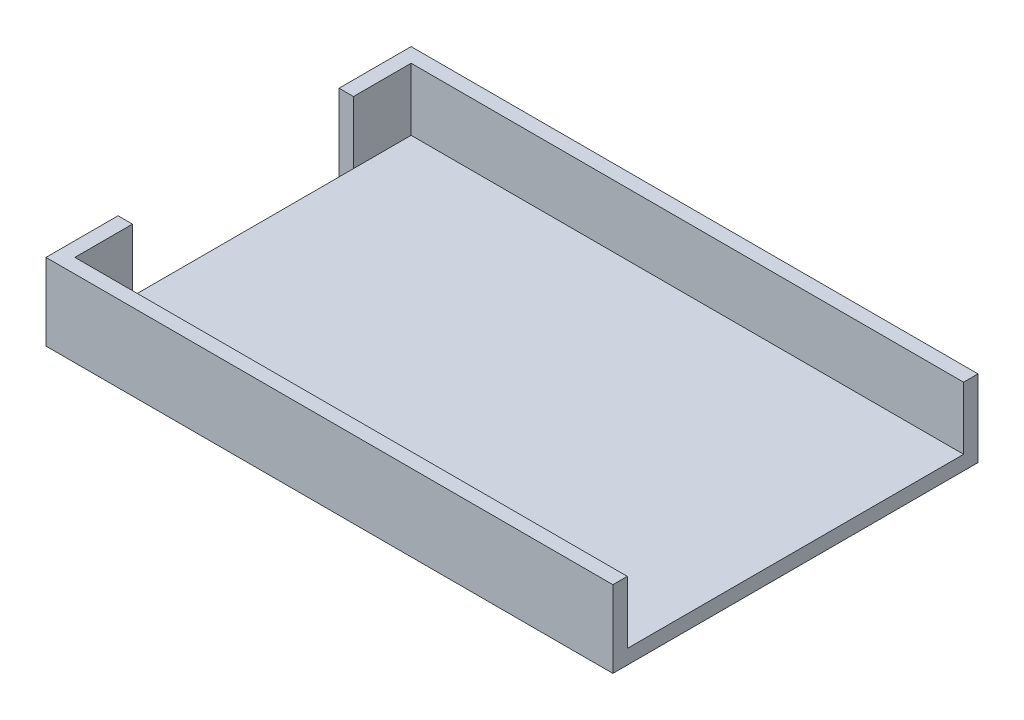
ISO-10303-21;
HEADER;
FILE_DESCRIPTION(('STEP AP214'),'2;1');
FILE_NAME('part.step','',(''),(''),'','','');
FILE_SCHEMA(('AUTOMOTIVE_DESIGN { 1 0 10303 214 1 1 1 1 }'));
ENDSEC;
DATA;
#1=APPLICATION_CONTEXT('core data for automotive mechanical design processes');
#2=APPLICATION_PROTOCOL_DEFINITION('international standard','automotive_design',2000,#1);
#3=PRODUCT_CONTEXT('',#1,'mechanical');
#4=PRODUCT('Part','Part','',(#3));
#5=PRODUCT_RELATED_PRODUCT_CATEGORY('part','',(#4));
#6=PRODUCT_DEFINITION_FORMATION('','',#4);
#7=PRODUCT_DEFINITION_CONTEXT('part definition',#1,'design');
#8=PRODUCT_DEFINITION('design','',#6,#7);
#9=PRODUCT_DEFINITION_SHAPE('','',#8);
#10=(LENGTH_UNIT() NAMED_UNIT(*) SI_UNIT(.MILLI.,.METRE.));
#11=(NAMED_UNIT(*) PLANE_ANGLE_UNIT() SI_UNIT($,.RADIAN.));
#12=(NAMED_UNIT(*) SI_UNIT($,.STERADIAN.) SOLID_ANGLE_UNIT());
#13=UNCERTAINTY_MEASURE_WITH_UNIT(LENGTH_MEASURE(1.E-05),#10,'distance_accuracy_value','');
#14=(GEOMETRIC_REPRESENTATION_CONTEXT(3) GLOBAL_UNCERTAINTY_ASSIGNED_CONTEXT((#13)) GLOBAL_UNIT_ASSIGNED_CONTEXT((#10,
#11,#12)) REPRESENTATION_CONTEXT('',''));
#15=CARTESIAN_POINT('',(0.,0.,0.));
#16=DIRECTION('',(0.,0.,1.));
#17=DIRECTION('',(1.,0.,0.));
#18=AXIS2_PLACEMENT_3D('',#15,#16,#17);
#19=CARTESIAN_POINT('',(-81.5855731865285,4.7625,-39.8468669041451));
#20=DIRECTION('',(1.,0.,0.));
#21=DIRECTION('',(0.,0.,-1.));
#22=AXIS2_PLACEMENT_3D('',#19,#20,#21);
#23=PLANE('',#22);
#24=DIRECTION('',(0.,0.,1.));
#25=VECTOR('',#24,1.);
#26=CARTESIAN_POINT('',(-81.5855731865285,4.7625,-39.8468669041451));
#27=LINE('',#26,#25);
#28=CARTESIAN_POINT('',(-81.5855731865285,4.7625,-20.7968669041451));
#29=VERTEX_POINT('',#28);
#30=CARTESIAN_POINT('',(-81.5855731865285,4.7625,52.2281330958549));
#31=VERTEX_POINT('',#30);
#32=EDGE_CURVE('E49',#29,#31,#27,.T.);
#33=ORIENTED_EDGE('',*,*,#32,.F.);
#34=DIRECTION('',(0.,-1.,0.));
#35=VECTOR('',#34,1.);
#36=CARTESIAN_POINT('',(-81.5855731865285,25.4,-20.7968669041451));
#37=LINE('',#36,#35);
#38=CARTESIAN_POINT('',(-81.5855731865285,0.,-20.7968669041451));
#39=VERTEX_POINT('',#38);
#40=EDGE_CURVE('E136',#29,#39,#37,.T.);
#41=ORIENTED_EDGE('',*,*,#40,.T.);
#42=DIRECTION('',(0.,0.,1.));
#43=VECTOR('',#42,1.);
#44=CARTESIAN_POINT('',(-81.5855731865285,0.,-39.8468669041451));
#45=LINE('',#44,#43);
#46=CARTESIAN_POINT('',(-81.5855731865285,0.,52.2281330958549));
#47=VERTEX_POINT('',#46);
#48=EDGE_CURVE('E228',#39,#47,#45,.T.);
#49=ORIENTED_EDGE('',*,*,#48,.T.);
#50=DIRECTION('',(0.,-1.,0.));
#51=VECTOR('',#50,1.);
#52=CARTESIAN_POINT('',(-81.5855731865285,25.4,52.2281330958549));
#53=LINE('',#52,#51);
#54=EDGE_CURVE('E215',#31,#47,#53,.T.);
#55=ORIENTED_EDGE('',*,*,#54,.F.);
#56=EDGE_LOOP('',(#33,#41,#49,#55));
#57=FACE_BOUND('',#56,.T.);
#58=ADVANCED_FACE('F33',(#57),#23,.F.);
#59=CARTESIAN_POINT('',(100.976926813471,4.7625,-39.8468669041451));
#60=DIRECTION('',(-1.,0.,0.));
#61=DIRECTION('',(0.,0.,1.));
#62=AXIS2_PLACEMENT_3D('',#59,#60,#61);
#63=PLANE('',#62);
#64=DIRECTION('',(0.,0.,-1.));
#65=VECTOR('',#64,1.);
#66=CARTESIAN_POINT('',(100.976926813471,0.,-39.8468669041451));
#67=LINE('',#66,#65);
#68=CARTESIAN_POINT('',(100.976926813471,0.,76.0406330958549));
#69=VERTEX_POINT('',#68);
#70=CARTESIAN_POINT('',(100.976926813471,0.,-44.6093669041451));
#71=VERTEX_POINT('',#70);
#72=EDGE_CURVE('E36',#69,#71,#67,.T.);
#73=ORIENTED_EDGE('',*,*,#72,.T.);
#74=DIRECTION('',(0.,-1.,0.));
#75=VECTOR('',#74,1.);
#76=CARTESIAN_POINT('',(100.976926813471,25.4,-44.6093669041451));
#77=LINE('',#76,#75);
#78=CARTESIAN_POINT('',(100.976926813471,25.4,-44.6093669041451));
#79=VERTEX_POINT('',#78);
#80=EDGE_CURVE('E173',#79,#71,#77,.T.);
#81=ORIENTED_EDGE('',*,*,#80,.F.);
#82=DIRECTION('',(0.,0.,1.));
#83=VECTOR('',#82,1.);
#84=CARTESIAN_POINT('',(100.976926813471,25.4,-44.6093669041451));
#85=LINE('',#84,#83);
#86=CARTESIAN_POINT('',(100.976926813471,25.4,-39.8468669041451));
#87=VERTEX_POINT('',#86);
#88=EDGE_CURVE('E137',#79,#87,#85,.T.);
#89=ORIENTED_EDGE('',*,*,#88,.T.);
#90=DIRECTION('',(0.,-1.,0.));
#91=VECTOR('',#90,1.);
#92=CARTESIAN_POINT('',(100.976926813471,25.4,-39.8468669041451));
#93=LINE('',#92,#91);
#94=CARTESIAN_POINT('',(100.976926813471,4.7625,-39.8468669041451));
#95=VERTEX_POINT('',#94);
#96=EDGE_CURVE('E152',#87,#95,#93,.T.);
#97=ORIENTED_EDGE('',*,*,#96,.T.);
#98=DIRECTION('',(0.,0.,-1.));
#99=VECTOR('',#98,1.);
#100=CARTESIAN_POINT('',(100.976926813471,4.7625,-39.8468669041451));
#101=LINE('',#100,#99);
#102=CARTESIAN_POINT('',(100.976926813471,4.7625,71.2781330958549));
#103=VERTEX_POINT('',#102);
#104=EDGE_CURVE('E41',#103,#95,#101,.T.);
#105=ORIENTED_EDGE('',*,*,#104,.F.);
#106=DIRECTION('',(0.,-1.,0.));
#107=VECTOR('',#106,1.);
#108=CARTESIAN_POINT('',(100.976926813471,25.4,71.2781330958549));
#109=LINE('',#108,#107);
#110=CARTESIAN_POINT('',(100.976926813471,25.4,71.2781330958549));
#111=VERTEX_POINT('',#110);
#112=EDGE_CURVE('E200',#111,#103,#109,.T.);
#113=ORIENTED_EDGE('',*,*,#112,.F.);
#114=DIRECTION('',(0.,0.,1.));
#115=VECTOR('',#114,1.);
#116=CARTESIAN_POINT('',(100.976926813471,25.4,71.2781330958549));
#117=LINE('',#116,#115);
#118=CARTESIAN_POINT('',(100.976926813471,25.4,76.0406330958549));
#119=VERTEX_POINT('',#118);
#120=EDGE_CURVE('E186',#111,#119,#117,.T.);
#121=ORIENTED_EDGE('',*,*,#120,.T.);
#122=DIRECTION('',(0.,-1.,0.));
#123=VECTOR('',#122,1.);
#124=CARTESIAN_POINT('',(100.976926813471,25.4,76.0406330958549));
#125=LINE('',#124,#123);
#126=EDGE_CURVE('E221',#119,#69,#125,.T.);
#127=ORIENTED_EDGE('',*,*,#126,.T.);
#128=EDGE_LOOP('',(#73,#81,#89,#97,#105,#113,#121,#127));
#129=FACE_BOUND('',#128,.T.);
#130=ADVANCED_FACE('F234',(#129),#63,.F.);
#131=CARTESIAN_POINT('',(0.,4.7625,0.));
#132=DIRECTION('',(0.,1.,0.));
#133=DIRECTION('',(0.,0.,1.));
#134=AXIS2_PLACEMENT_3D('',#131,#132,#133);
#135=PLANE('',#134);
#136=CARTESIAN_POINT('',(-81.5855731865285,4.7625,-39.8468669041451));
#137=VERTEX_POINT('',#136);
#138=EDGE_CURVE('E132',#137,#29,#27,.T.);
#139=ORIENTED_EDGE('',*,*,#138,.T.);
#140=ORIENTED_EDGE('',*,*,#32,.T.);
#141=DIRECTION('',(0.,0.,-1.));
#142=VECTOR('',#141,1.);
#143=CARTESIAN_POINT('',(-81.5855731865285,4.7625,0.));
#144=LINE('',#143,#142);
#145=CARTESIAN_POINT('',(-81.5855731865285,4.7625,71.2781330958549));
#146=VERTEX_POINT('',#145);
#147=EDGE_CURVE('E211',#146,#31,#144,.T.);
#148=ORIENTED_EDGE('',*,*,#147,.F.);
#149=DIRECTION('',(1.,0.,0.));
#150=VECTOR('',#149,1.);
#151=CARTESIAN_POINT('',(-81.5855731865285,4.7625,71.2781330958549));
#152=LINE('',#151,#150);
#153=EDGE_CURVE('E230',#146,#103,#152,.T.);
#154=ORIENTED_EDGE('',*,*,#153,.T.);
#155=ORIENTED_EDGE('',*,*,#104,.T.);
#156=DIRECTION('',(-1.,0.,0.));
#157=VECTOR('',#156,1.);
#158=CARTESIAN_POINT('',(-81.5855731865285,4.7625,-39.8468669041451));
#159=LINE('',#158,#157);
#160=EDGE_CURVE('E11',#95,#137,#159,.T.);
#161=ORIENTED_EDGE('',*,*,#160,.T.);
#162=EDGE_LOOP('',(#139,#140,#148,#154,#155,#161));
#163=FACE_BOUND('',#162,.T.);
#164=ADVANCED_FACE('F253',(#163),#135,.T.);
#165=CARTESIAN_POINT('',(0.,0.,0.));
#166=DIRECTION('',(0.,1.,0.));
#167=DIRECTION('',(0.,0.,1.));
#168=AXIS2_PLACEMENT_3D('',#165,#166,#167);
#169=PLANE('',#168);
#170=ORIENTED_EDGE('',*,*,#72,.F.);
#171=DIRECTION('',(-1.,0.,0.));
#172=VECTOR('',#171,1.);
#173=CARTESIAN_POINT('',(-86.3480731865285,0.,76.0406330958549));
#174=LINE('',#173,#172);
#175=CARTESIAN_POINT('',(-86.3480731865285,0.,76.0406330958549));
#176=VERTEX_POINT('',#175);
#177=EDGE_CURVE('E172',#69,#176,#174,.T.);
#178=ORIENTED_EDGE('',*,*,#177,.T.);
#179=DIRECTION('',(0.,0.,-1.));
#180=VECTOR('',#179,1.);
#181=CARTESIAN_POINT('',(-86.3480731865285,0.,71.2781330958549));
#182=LINE('',#181,#180);
#183=CARTESIAN_POINT('',(-86.3480731865285,0.,52.2281330958549));
#184=VERTEX_POINT('',#183);
#185=EDGE_CURVE('E203',#176,#184,#182,.T.);
#186=ORIENTED_EDGE('',*,*,#185,.T.);
#187=DIRECTION('',(1.,0.,0.));
#188=VECTOR('',#187,1.);
#189=CARTESIAN_POINT('',(-86.3480731865285,0.,52.2281330958549));
#190=LINE('',#189,#188);
#191=EDGE_CURVE('E187',#184,#47,#190,.T.);
#192=ORIENTED_EDGE('',*,*,#191,.T.);
#193=ORIENTED_EDGE('',*,*,#48,.F.);
#194=DIRECTION('',(-1.,0.,0.));
#195=VECTOR('',#194,1.);
#196=CARTESIAN_POINT('',(-86.3480731865285,0.,-20.7968669041451));
#197=LINE('',#196,#195);
#198=CARTESIAN_POINT('',(-86.3480731865285,0.,-20.7968669041451));
#199=VERTEX_POINT('',#198);
#200=EDGE_CURVE('E166',#39,#199,#197,.T.);
#201=ORIENTED_EDGE('',*,*,#200,.T.);
#202=DIRECTION('',(0.,0.,-1.));
#203=VECTOR('',#202,1.);
#204=CARTESIAN_POINT('',(-86.3480731865285,0.,-39.8468669041451));
#205=LINE('',#204,#203);
#206=CARTESIAN_POINT('',(-86.3480731865285,0.,-44.6093669041451));
#207=VERTEX_POINT('',#206);
#208=EDGE_CURVE('E156',#199,#207,#205,.T.);
#209=ORIENTED_EDGE('',*,*,#208,.T.);
#210=DIRECTION('',(1.,0.,0.));
#211=VECTOR('',#210,1.);
#212=CARTESIAN_POINT('',(-86.3480731865285,0.,-44.6093669041451));
#213=LINE('',#212,#211);
#214=EDGE_CURVE('E153',#207,#71,#213,.T.);
#215=ORIENTED_EDGE('',*,*,#214,.T.);
#216=EDGE_LOOP('',(#170,#178,#186,#192,#193,#201,#209,#215));
#217=FACE_BOUND('',#216,.T.);
#218=ADVANCED_FACE('F242',(#217),#169,.F.);
#219=CARTESIAN_POINT('',(-81.5855731865285,25.4,71.2781330958549));
#220=DIRECTION('',(0.,0.,-1.));
#221=DIRECTION('',(-1.,0.,0.));
#222=AXIS2_PLACEMENT_3D('',#219,#220,#221);
#223=PLANE('',#222);
#224=ORIENTED_EDGE('',*,*,#112,.T.);
#225=ORIENTED_EDGE('',*,*,#153,.F.);
#226=DIRECTION('',(0.,-1.,0.));
#227=VECTOR('',#226,1.);
#228=CARTESIAN_POINT('',(-81.5855731865285,25.4,71.2781330958549));
#229=LINE('',#228,#227);
#230=CARTESIAN_POINT('',(-81.5855731865285,25.4,71.2781330958549));
#231=VERTEX_POINT('',#230);
#232=EDGE_CURVE('E208',#231,#146,#229,.T.);
#233=ORIENTED_EDGE('',*,*,#232,.F.);
#234=DIRECTION('',(1.,0.,0.));
#235=VECTOR('',#234,1.);
#236=CARTESIAN_POINT('',(-81.5855731865285,25.4,71.2781330958549));
#237=LINE('',#236,#235);
#238=EDGE_CURVE('E183',#231,#111,#237,.T.);
#239=ORIENTED_EDGE('',*,*,#238,.T.);
#240=EDGE_LOOP('',(#224,#225,#233,#239));
#241=FACE_BOUND('',#240,.T.);
#242=ADVANCED_FACE('F260',(#241),#223,.T.);
#243=CARTESIAN_POINT('',(-81.5855731865285,25.4,52.2281330958549));
#244=DIRECTION('',(1.,0.,0.));
#245=DIRECTION('',(0.,0.,-1.));
#246=AXIS2_PLACEMENT_3D('',#243,#244,#245);
#247=PLANE('',#246);
#248=ORIENTED_EDGE('',*,*,#232,.T.);
#249=ORIENTED_EDGE('',*,*,#147,.T.);
#250=CARTESIAN_POINT('',(-81.5855731865285,25.4,52.2281330958549));
#251=VERTEX_POINT('',#250);
#252=EDGE_CURVE('E212',#251,#31,#53,.T.);
#253=ORIENTED_EDGE('',*,*,#252,.F.);
#254=DIRECTION('',(0.,0.,1.));
#255=VECTOR('',#254,1.);
#256=CARTESIAN_POINT('',(-81.5855731865285,25.4,52.2281330958549));
#257=LINE('',#256,#255);
#258=EDGE_CURVE('E197',#251,#231,#257,.T.);
#259=ORIENTED_EDGE('',*,*,#258,.T.);
#260=EDGE_LOOP('',(#248,#249,#253,#259));
#261=FACE_BOUND('',#260,.T.);
#262=ADVANCED_FACE('F264',(#261),#247,.T.);
#263=CARTESIAN_POINT('',(-86.3480731865285,25.4,52.2281330958549));
#264=DIRECTION('',(0.,0.,-1.));
#265=DIRECTION('',(-1.,0.,0.));
#266=AXIS2_PLACEMENT_3D('',#263,#264,#265);
#267=PLANE('',#266);
#268=ORIENTED_EDGE('',*,*,#191,.F.);
#269=DIRECTION('',(0.,-1.,0.));
#270=VECTOR('',#269,1.);
#271=CARTESIAN_POINT('',(-86.3480731865285,25.4,52.2281330958549));
#272=LINE('',#271,#270);
#273=CARTESIAN_POINT('',(-86.3480731865285,25.4,52.2281330958549));
#274=VERTEX_POINT('',#273);
#275=EDGE_CURVE('E216',#274,#184,#272,.T.);
#276=ORIENTED_EDGE('',*,*,#275,.F.);
#277=DIRECTION('',(1.,0.,0.));
#278=VECTOR('',#277,1.);
#279=CARTESIAN_POINT('',(-86.3480731865285,25.4,52.2281330958549));
#280=LINE('',#279,#278);
#281=EDGE_CURVE('E194',#274,#251,#280,.T.);
#282=ORIENTED_EDGE('',*,*,#281,.T.);
#283=ORIENTED_EDGE('',*,*,#252,.T.);
#284=ORIENTED_EDGE('',*,*,#54,.T.);
#285=EDGE_LOOP('',(#268,#276,#282,#283,#284));
#286=FACE_BOUND('',#285,.T.);
#287=ADVANCED_FACE('F274',(#286),#267,.T.);
#288=CARTESIAN_POINT('',(-86.3480731865285,25.4,71.2781330958549));
#289=DIRECTION('',(-1.,0.,0.));
#290=DIRECTION('',(0.,0.,1.));
#291=AXIS2_PLACEMENT_3D('',#288,#289,#290);
#292=PLANE('',#291);
#293=ORIENTED_EDGE('',*,*,#185,.F.);
#294=DIRECTION('',(0.,-1.,0.));
#295=VECTOR('',#294,1.);
#296=CARTESIAN_POINT('',(-86.3480731865285,25.4,76.0406330958549));
#297=LINE('',#296,#295);
#298=CARTESIAN_POINT('',(-86.3480731865285,25.4,76.0406330958549));
#299=VERTEX_POINT('',#298);
#300=EDGE_CURVE('E218',#299,#176,#297,.T.);
#301=ORIENTED_EDGE('',*,*,#300,.F.);
#302=DIRECTION('',(0.,0.,-1.));
#303=VECTOR('',#302,1.);
#304=CARTESIAN_POINT('',(-86.3480731865285,25.4,71.2781330958549));
#305=LINE('',#304,#303);
#306=EDGE_CURVE('E192',#299,#274,#305,.T.);
#307=ORIENTED_EDGE('',*,*,#306,.T.);
#308=ORIENTED_EDGE('',*,*,#275,.T.);
#309=EDGE_LOOP('',(#293,#301,#307,#308));
#310=FACE_BOUND('',#309,.T.);
#311=ADVANCED_FACE('F270',(#310),#292,.T.);
#312=CARTESIAN_POINT('',(-86.3480731865285,25.4,76.0406330958549));
#313=DIRECTION('',(0.,0.,1.));
#314=DIRECTION('',(1.,0.,0.));
#315=AXIS2_PLACEMENT_3D('',#312,#313,#314);
#316=PLANE('',#315);
#317=ORIENTED_EDGE('',*,*,#177,.F.);
#318=ORIENTED_EDGE('',*,*,#126,.F.);
#319=DIRECTION('',(-1.,0.,0.));
#320=VECTOR('',#319,1.);
#321=CARTESIAN_POINT('',(-81.5855731865285,25.4,76.0406330958549));
#322=LINE('',#321,#320);
#323=EDGE_CURVE('E190',#119,#299,#322,.T.);
#324=ORIENTED_EDGE('',*,*,#323,.T.);
#325=ORIENTED_EDGE('',*,*,#300,.T.);
#326=EDGE_LOOP('',(#317,#318,#324,#325));
#327=FACE_BOUND('',#326,.T.);
#328=ADVANCED_FACE('F266',(#327),#316,.T.);
#329=CARTESIAN_POINT('',(0.,25.4,0.));
#330=DIRECTION('',(0.,-1.,0.));
#331=DIRECTION('',(0.,0.,-1.));
#332=AXIS2_PLACEMENT_3D('',#329,#330,#331);
#333=PLANE('',#332);
#334=ORIENTED_EDGE('',*,*,#238,.F.);
#335=ORIENTED_EDGE('',*,*,#258,.F.);
#336=ORIENTED_EDGE('',*,*,#281,.F.);
#337=ORIENTED_EDGE('',*,*,#306,.F.);
#338=ORIENTED_EDGE('',*,*,#323,.F.);
#339=ORIENTED_EDGE('',*,*,#120,.F.);
#340=EDGE_LOOP('',(#334,#335,#336,#337,#338,#339));
#341=FACE_BOUND('',#340,.T.);
#342=ADVANCED_FACE('F269',(#341),#333,.F.);
#343=CARTESIAN_POINT('',(100.976926813471,25.4,-39.8468669041451));
#344=DIRECTION('',(0.,0.,1.));
#345=DIRECTION('',(1.,0.,0.));
#346=AXIS2_PLACEMENT_3D('',#343,#344,#345);
#347=PLANE('',#346);
#348=DIRECTION('',(0.,-1.,0.));
#349=VECTOR('',#348,1.);
#350=CARTESIAN_POINT('',(-81.5855731865285,25.4,-39.8468669041451));
#351=LINE('',#350,#349);
#352=CARTESIAN_POINT('',(-81.5855731865285,25.4,-39.8468669041451));
#353=VERTEX_POINT('',#352);
#354=EDGE_CURVE('E127',#353,#137,#351,.T.);
#355=ORIENTED_EDGE('',*,*,#354,.T.);
#356=ORIENTED_EDGE('',*,*,#160,.F.);
#357=ORIENTED_EDGE('',*,*,#96,.F.);
#358=DIRECTION('',(-1.,0.,0.));
#359=VECTOR('',#358,1.);
#360=CARTESIAN_POINT('',(100.976926813471,25.4,-39.8468669041451));
#361=LINE('',#360,#359);
#362=EDGE_CURVE('E144',#87,#353,#361,.T.);
#363=ORIENTED_EDGE('',*,*,#362,.T.);
#364=EDGE_LOOP('',(#355,#356,#357,#363));
#365=FACE_BOUND('',#364,.T.);
#366=ADVANCED_FACE('F150',(#365),#347,.T.);
#367=CARTESIAN_POINT('',(-86.3480731865285,25.4,-44.6093669041451));
#368=DIRECTION('',(0.,0.,-1.));
#369=DIRECTION('',(-1.,0.,0.));
#370=AXIS2_PLACEMENT_3D('',#367,#368,#369);
#371=PLANE('',#370);
#372=ORIENTED_EDGE('',*,*,#214,.F.);
#373=DIRECTION('',(0.,-1.,0.));
#374=VECTOR('',#373,1.);
#375=CARTESIAN_POINT('',(-86.3480731865285,25.4,-44.6093669041451));
#376=LINE('',#375,#374);
#377=CARTESIAN_POINT('',(-86.3480731865285,25.4,-44.6093669041451));
#378=VERTEX_POINT('',#377);
#379=EDGE_CURVE('E176',#378,#207,#376,.T.);
#380=ORIENTED_EDGE('',*,*,#379,.F.);
#381=DIRECTION('',(1.,0.,0.));
#382=VECTOR('',#381,1.);
#383=CARTESIAN_POINT('',(-86.3480731865285,25.4,-44.6093669041451));
#384=LINE('',#383,#382);
#385=EDGE_CURVE('E162',#378,#79,#384,.T.);
#386=ORIENTED_EDGE('',*,*,#385,.T.);
#387=ORIENTED_EDGE('',*,*,#80,.T.);
#388=EDGE_LOOP('',(#372,#380,#386,#387));
#389=FACE_BOUND('',#388,.T.);
#390=ADVANCED_FACE('F239',(#389),#371,.T.);
#391=CARTESIAN_POINT('',(-86.3480731865285,25.4,-39.8468669041451));
#392=DIRECTION('',(-1.,0.,0.));
#393=DIRECTION('',(0.,0.,1.));
#394=AXIS2_PLACEMENT_3D('',#391,#392,#393);
#395=PLANE('',#394);
#396=ORIENTED_EDGE('',*,*,#208,.F.);
#397=DIRECTION('',(0.,-1.,0.));
#398=VECTOR('',#397,1.);
#399=CARTESIAN_POINT('',(-86.3480731865285,25.4,-20.7968669041451));
#400=LINE('',#399,#398);
#401=CARTESIAN_POINT('',(-86.3480731865285,25.4,-20.7968669041451));
#402=VERTEX_POINT('',#401);
#403=EDGE_CURVE('E178',#402,#199,#400,.T.);
#404=ORIENTED_EDGE('',*,*,#403,.F.);
#405=DIRECTION('',(0.,0.,-1.));
#406=VECTOR('',#405,1.);
#407=CARTESIAN_POINT('',(-86.3480731865285,25.4,-39.8468669041451));
#408=LINE('',#407,#406);
#409=EDGE_CURVE('E160',#402,#378,#408,.T.);
#410=ORIENTED_EDGE('',*,*,#409,.T.);
#411=ORIENTED_EDGE('',*,*,#379,.T.);
#412=EDGE_LOOP('',(#396,#404,#410,#411));
#413=FACE_BOUND('',#412,.T.);
#414=ADVANCED_FACE('F245',(#413),#395,.T.);
#415=CARTESIAN_POINT('',(-86.3480731865285,25.4,-20.7968669041451));
#416=DIRECTION('',(0.,0.,1.));
#417=DIRECTION('',(1.,0.,0.));
#418=AXIS2_PLACEMENT_3D('',#415,#416,#417);
#419=PLANE('',#418);
#420=ORIENTED_EDGE('',*,*,#200,.F.);
#421=ORIENTED_EDGE('',*,*,#40,.F.);
#422=CARTESIAN_POINT('',(-81.5855731865285,25.4,-20.7968669041451));
#423=VERTEX_POINT('',#422);
#424=EDGE_CURVE('E181',#423,#29,#37,.T.);
#425=ORIENTED_EDGE('',*,*,#424,.F.);
#426=DIRECTION('',(-1.,0.,0.));
#427=VECTOR('',#426,1.);
#428=CARTESIAN_POINT('',(-86.3480731865285,25.4,-20.7968669041451));
#429=LINE('',#428,#427);
#430=EDGE_CURVE('E148',#423,#402,#429,.T.);
#431=ORIENTED_EDGE('',*,*,#430,.T.);
#432=ORIENTED_EDGE('',*,*,#403,.T.);
#433=EDGE_LOOP('',(#420,#421,#425,#431,#432));
#434=FACE_BOUND('',#433,.T.);
#435=ADVANCED_FACE('F247',(#434),#419,.T.);
#436=CARTESIAN_POINT('',(-81.5855731865285,25.4,-20.7968669041451));
#437=DIRECTION('',(1.,0.,0.));
#438=DIRECTION('',(0.,0.,-1.));
#439=AXIS2_PLACEMENT_3D('',#436,#437,#438);
#440=PLANE('',#439);
#441=ORIENTED_EDGE('',*,*,#424,.T.);
#442=ORIENTED_EDGE('',*,*,#138,.F.);
#443=ORIENTED_EDGE('',*,*,#354,.F.);
#444=DIRECTION('',(0.,0.,1.));
#445=VECTOR('',#444,1.);
#446=CARTESIAN_POINT('',(-81.5855731865285,25.4,-20.7968669041451));
#447=LINE('',#446,#445);
#448=EDGE_CURVE('E131',#353,#423,#447,.T.);
#449=ORIENTED_EDGE('',*,*,#448,.T.);
#450=EDGE_LOOP('',(#441,#442,#443,#449));
#451=FACE_BOUND('',#450,.T.);
#452=ADVANCED_FACE('F130',(#451),#440,.T.);
#453=CARTESIAN_POINT('',(0.,25.4,0.));
#454=DIRECTION('',(0.,-1.,0.));
#455=DIRECTION('',(0.,0.,-1.));
#456=AXIS2_PLACEMENT_3D('',#453,#454,#455);
#457=PLANE('',#456);
#458=ORIENTED_EDGE('',*,*,#362,.F.);
#459=ORIENTED_EDGE('',*,*,#88,.F.);
#460=ORIENTED_EDGE('',*,*,#385,.F.);
#461=ORIENTED_EDGE('',*,*,#409,.F.);
#462=ORIENTED_EDGE('',*,*,#430,.F.);
#463=ORIENTED_EDGE('',*,*,#448,.F.);
#464=EDGE_LOOP('',(#458,#459,#460,#461,#462,#463));
#465=FACE_BOUND('',#464,.T.);
#466=ADVANCED_FACE('F142',(#465),#457,.F.);
#467=CLOSED_SHELL('',(#58,#130,#164,#218,#242,#262,#287,#311,#328,#342,#366,#390,#414,#435,#452,#466));
#468=MANIFOLD_SOLID_BREP('B2',#467);
#469=ADVANCED_BREP_SHAPE_REPRESENTATION('',(#18,#468),#14);
#470=SHAPE_DEFINITION_REPRESENTATION(#9,#469);
ENDSEC;
END-ISO-10303-21;
